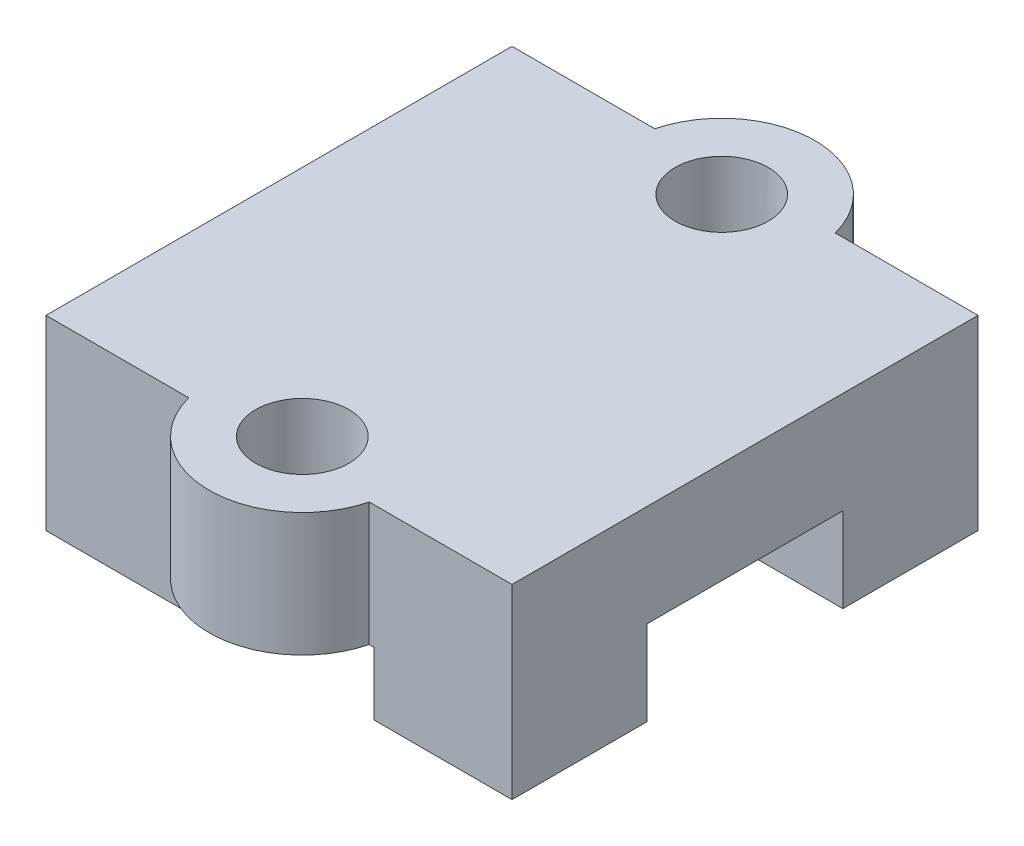
ISO-10303-21;
HEADER;
FILE_DESCRIPTION(('STEP AP214'),'2;1');
FILE_NAME('part.step','',(''),(''),'','','');
FILE_SCHEMA(('AUTOMOTIVE_DESIGN { 1 0 10303 214 1 1 1 1 }'));
ENDSEC;
DATA;
#1=APPLICATION_CONTEXT('core data for automotive mechanical design processes');
#2=APPLICATION_PROTOCOL_DEFINITION('international standard','automotive_design',2000,#1);
#3=PRODUCT_CONTEXT('',#1,'mechanical');
#4=PRODUCT('Part','Part','',(#3));
#5=PRODUCT_RELATED_PRODUCT_CATEGORY('part','',(#4));
#6=PRODUCT_DEFINITION_FORMATION('','',#4);
#7=PRODUCT_DEFINITION_CONTEXT('part definition',#1,'design');
#8=PRODUCT_DEFINITION('design','',#6,#7);
#9=PRODUCT_DEFINITION_SHAPE('','',#8);
#10=(LENGTH_UNIT() NAMED_UNIT(*) SI_UNIT(.MILLI.,.METRE.));
#11=(NAMED_UNIT(*) PLANE_ANGLE_UNIT() SI_UNIT($,.RADIAN.));
#12=(NAMED_UNIT(*) SI_UNIT($,.STERADIAN.) SOLID_ANGLE_UNIT());
#13=UNCERTAINTY_MEASURE_WITH_UNIT(LENGTH_MEASURE(1.E-05),#10,'distance_accuracy_value','');
#14=(GEOMETRIC_REPRESENTATION_CONTEXT(3) GLOBAL_UNCERTAINTY_ASSIGNED_CONTEXT((#13)) GLOBAL_UNIT_ASSIGNED_CONTEXT((#10,
#11,#12)) REPRESENTATION_CONTEXT('',''));
#15=CARTESIAN_POINT('',(0.,0.,0.));
#16=DIRECTION('',(0.,0.,1.));
#17=DIRECTION('',(1.,0.,0.));
#18=AXIS2_PLACEMENT_3D('',#15,#16,#17);
#19=CARTESIAN_POINT('',(-110.,-5.00000000000001,9.));
#20=DIRECTION('',(0.,1.,0.));
#21=DIRECTION('',(0.,0.,1.));
#22=AXIS2_PLACEMENT_3D('',#19,#20,#21);
#23=CYLINDRICAL_SURFACE('',#22,4.00000000000001);
#24=DIRECTION('',(0.,1.,0.));
#25=VECTOR('',#24,1.);
#26=CARTESIAN_POINT('',(-113.872983346207,-5.00000000000001,10.));
#27=LINE('',#26,#25);
#28=CARTESIAN_POINT('',(-113.872983346207,3.00000000000001,10.));
#29=VERTEX_POINT('',#28);
#30=CARTESIAN_POINT('',(-113.872983346207,-2.3,10.));
#31=VERTEX_POINT('',#30);
#32=EDGE_CURVE('E284',#29,#31,#27,.F.);
#33=ORIENTED_EDGE('',*,*,#32,.T.);
#34=CARTESIAN_POINT('',(-110.,-2.3,9.));
#35=DIRECTION('',(0.,-1.,0.));
#36=DIRECTION('',(0.,0.,-1.));
#37=AXIS2_PLACEMENT_3D('',#34,#35,#36);
#38=CIRCLE('',#37,4.00000000000001);
#39=CARTESIAN_POINT('',(-106.127016653793,-2.3,10.));
#40=VERTEX_POINT('',#39);
#41=EDGE_CURVE('E330',#31,#40,#38,.F.);
#42=ORIENTED_EDGE('',*,*,#41,.T.);
#43=DIRECTION('',(0.,1.,0.));
#44=VECTOR('',#43,1.);
#45=CARTESIAN_POINT('',(-106.127016653793,-5.00000000000001,10.));
#46=LINE('',#45,#44);
#47=CARTESIAN_POINT('',(-106.127016653793,3.00000000000001,10.));
#48=VERTEX_POINT('',#47);
#49=EDGE_CURVE('E281',#40,#48,#46,.T.);
#50=ORIENTED_EDGE('',*,*,#49,.T.);
#51=CARTESIAN_POINT('',(-110.,3.00000000000001,9.00000000000001));
#52=DIRECTION('',(0.,1.,0.));
#53=DIRECTION('',(0.,0.,1.));
#54=AXIS2_PLACEMENT_3D('',#51,#52,#53);
#55=CIRCLE('',#54,4.00000000000001);
#56=EDGE_CURVE('E288',#29,#48,#55,.T.);
#57=ORIENTED_EDGE('',*,*,#56,.F.);
#58=EDGE_LOOP('',(#33,#42,#50,#57));
#59=FACE_BOUND('',#58,.T.);
#60=ADVANCED_FACE('F45',(#59),#23,.T.);
#61=CARTESIAN_POINT('',(-110.,-5.,-9.));
#62=DIRECTION('',(0.,1.,0.));
#63=DIRECTION('',(0.,0.,1.));
#64=AXIS2_PLACEMENT_3D('',#61,#62,#63);
#65=CYLINDRICAL_SURFACE('',#64,4.00000000000001);
#66=DIRECTION('',(0.,1.,0.));
#67=VECTOR('',#66,1.);
#68=CARTESIAN_POINT('',(-106.127016653793,-5.,-10.));
#69=LINE('',#68,#67);
#70=CARTESIAN_POINT('',(-106.127016653793,3.00000000000001,-10.));
#71=VERTEX_POINT('',#70);
#72=CARTESIAN_POINT('',(-106.127016653793,-2.3,-10.));
#73=VERTEX_POINT('',#72);
#74=EDGE_CURVE('E295',#71,#73,#69,.F.);
#75=ORIENTED_EDGE('',*,*,#74,.T.);
#76=CARTESIAN_POINT('',(-110.,-2.3,-9.));
#77=DIRECTION('',(0.,-1.,0.));
#78=DIRECTION('',(0.,0.,-1.));
#79=AXIS2_PLACEMENT_3D('',#76,#77,#78);
#80=CIRCLE('',#79,4.00000000000001);
#81=CARTESIAN_POINT('',(-113.872983346207,-2.3,-10.));
#82=VERTEX_POINT('',#81);
#83=EDGE_CURVE('E321',#73,#82,#80,.F.);
#84=ORIENTED_EDGE('',*,*,#83,.T.);
#85=DIRECTION('',(0.,1.,0.));
#86=VECTOR('',#85,1.);
#87=CARTESIAN_POINT('',(-113.872983346207,-5.,-10.));
#88=LINE('',#87,#86);
#89=CARTESIAN_POINT('',(-113.872983346207,3.00000000000001,-10.));
#90=VERTEX_POINT('',#89);
#91=EDGE_CURVE('E292',#82,#90,#88,.T.);
#92=ORIENTED_EDGE('',*,*,#91,.T.);
#93=CARTESIAN_POINT('',(-110.,3.00000000000001,-9.));
#94=DIRECTION('',(0.,1.,0.));
#95=DIRECTION('',(0.,0.,1.));
#96=AXIS2_PLACEMENT_3D('',#93,#94,#95);
#97=CIRCLE('',#96,4.00000000000001);
#98=EDGE_CURVE('E299',#71,#90,#97,.T.);
#99=ORIENTED_EDGE('',*,*,#98,.F.);
#100=EDGE_LOOP('',(#75,#84,#92,#99));
#101=FACE_BOUND('',#100,.T.);
#102=ADVANCED_FACE('F400',(#101),#65,.T.);
#103=CARTESIAN_POINT('',(-110.,-6.99999999999999,-9.));
#104=DIRECTION('',(0.,1.,0.));
#105=DIRECTION('',(0.,0.,1.));
#106=AXIS2_PLACEMENT_3D('',#103,#104,#105);
#107=CYLINDRICAL_SURFACE('',#106,2.);
#108=CARTESIAN_POINT('',(-110.,3.00000000000001,-9.));
#109=DIRECTION('',(0.,1.,0.));
#110=DIRECTION('',(0.,0.,1.));
#111=AXIS2_PLACEMENT_3D('',#108,#109,#110);
#112=CIRCLE('',#111,2.);
#113=CARTESIAN_POINT('',(-110.,3.00000000000001,-7.));
#114=VERTEX_POINT('',#113);
#115=EDGE_CURVE('E179',#114,#114,#112,.T.);
#116=ORIENTED_EDGE('',*,*,#115,.T.);
#117=EDGE_LOOP('',(#116));
#118=FACE_BOUND('',#117,.T.);
#119=CARTESIAN_POINT('',(-110.,-2.3,-9.));
#120=DIRECTION('',(0.,-1.,0.));
#121=DIRECTION('',(0.,0.,-1.));
#122=AXIS2_PLACEMENT_3D('',#119,#120,#121);
#123=CIRCLE('',#122,2.);
#124=CARTESIAN_POINT('',(-110.,-2.3,-11.));
#125=VERTEX_POINT('',#124);
#126=EDGE_CURVE('E333',#125,#125,#123,.T.);
#127=ORIENTED_EDGE('',*,*,#126,.T.);
#128=EDGE_LOOP('',(#127));
#129=FACE_BOUND('',#128,.T.);
#130=ADVANCED_FACE('F415',(#118,#129),#107,.F.);
#131=CARTESIAN_POINT('',(-110.,-6.99999999999999,9.));
#132=DIRECTION('',(0.,1.,0.));
#133=DIRECTION('',(0.,0.,1.));
#134=AXIS2_PLACEMENT_3D('',#131,#132,#133);
#135=CYLINDRICAL_SURFACE('',#134,2.);
#136=CARTESIAN_POINT('',(-110.,3.00000000000001,9.00000000000001));
#137=DIRECTION('',(0.,1.,0.));
#138=DIRECTION('',(0.,0.,1.));
#139=AXIS2_PLACEMENT_3D('',#136,#137,#138);
#140=CIRCLE('',#139,2.);
#141=CARTESIAN_POINT('',(-110.,3.00000000000001,11.));
#142=VERTEX_POINT('',#141);
#143=EDGE_CURVE('E303',#142,#142,#140,.T.);
#144=ORIENTED_EDGE('',*,*,#143,.T.);
#145=EDGE_LOOP('',(#144));
#146=FACE_BOUND('',#145,.T.);
#147=CARTESIAN_POINT('',(-110.,-2.3,9.));
#148=DIRECTION('',(0.,-1.,0.));
#149=DIRECTION('',(0.,0.,-1.));
#150=AXIS2_PLACEMENT_3D('',#147,#148,#149);
#151=CIRCLE('',#150,2.);
#152=CARTESIAN_POINT('',(-110.,-2.3,7.00000000000001));
#153=VERTEX_POINT('',#152);
#154=EDGE_CURVE('E170',#153,#153,#151,.T.);
#155=ORIENTED_EDGE('',*,*,#154,.T.);
#156=EDGE_LOOP('',(#155));
#157=FACE_BOUND('',#156,.T.);
#158=ADVANCED_FACE('F349',(#146,#157),#135,.F.);
#159=CARTESIAN_POINT('',(-120.,-4.99999999999998,-10.));
#160=DIRECTION('',(0.,0.,-1.));
#161=DIRECTION('',(-1.,0.,0.));
#162=AXIS2_PLACEMENT_3D('',#159,#160,#161);
#163=PLANE('',#162);
#164=DIRECTION('',(0.,-1.,0.));
#165=VECTOR('',#164,1.);
#166=CARTESIAN_POINT('',(-114.079215610874,-2.3,-10.));
#167=LINE('',#166,#165);
#168=CARTESIAN_POINT('',(-114.079215610874,-5.,-10.));
#169=VERTEX_POINT('',#168);
#170=CARTESIAN_POINT('',(-114.079215610874,-2.3,-10.));
#171=VERTEX_POINT('',#170);
#172=EDGE_CURVE('E180',#169,#171,#167,.F.);
#173=ORIENTED_EDGE('',*,*,#172,.F.);
#174=DIRECTION('',(1.,0.,0.));
#175=VECTOR('',#174,1.);
#176=CARTESIAN_POINT('',(-120.,-4.99999999999998,-10.));
#177=LINE('',#176,#175);
#178=CARTESIAN_POINT('',(-120.,-4.99999999999998,-10.));
#179=VERTEX_POINT('',#178);
#180=EDGE_CURVE('E202',#179,#169,#177,.T.);
#181=ORIENTED_EDGE('',*,*,#180,.F.);
#182=DIRECTION('',(0.,1.,0.));
#183=VECTOR('',#182,1.);
#184=CARTESIAN_POINT('',(-120.,-4.99999999999998,-10.));
#185=LINE('',#184,#183);
#186=CARTESIAN_POINT('',(-120.,3.00000000000001,-10.));
#187=VERTEX_POINT('',#186);
#188=EDGE_CURVE('E226',#179,#187,#185,.T.);
#189=ORIENTED_EDGE('',*,*,#188,.T.);
#190=DIRECTION('',(1.,0.,0.));
#191=VECTOR('',#190,1.);
#192=CARTESIAN_POINT('',(-120.,3.00000000000001,-10.));
#193=LINE('',#192,#191);
#194=EDGE_CURVE('E197',#187,#90,#193,.T.);
#195=ORIENTED_EDGE('',*,*,#194,.T.);
#196=ORIENTED_EDGE('',*,*,#91,.F.);
#197=DIRECTION('',(-1.,0.,0.));
#198=VECTOR('',#197,1.);
#199=CARTESIAN_POINT('',(-120.,-2.3,-10.));
#200=LINE('',#199,#198);
#201=EDGE_CURVE('E69',#82,#171,#200,.T.);
#202=ORIENTED_EDGE('',*,*,#201,.T.);
#203=EDGE_LOOP('',(#173,#181,#189,#195,#196,#202));
#204=FACE_BOUND('',#203,.T.);
#205=ADVANCED_FACE('F394',(#204),#163,.T.);
#206=CARTESIAN_POINT('',(-120.,3.00000000000001,10.));
#207=DIRECTION('',(0.,0.,1.));
#208=DIRECTION('',(1.,0.,0.));
#209=AXIS2_PLACEMENT_3D('',#206,#207,#208);
#210=PLANE('',#209);
#211=DIRECTION('',(0.,-1.,0.));
#212=VECTOR('',#211,1.);
#213=CARTESIAN_POINT('',(-105.920784389126,-2.3,10.));
#214=LINE('',#213,#212);
#215=CARTESIAN_POINT('',(-105.920784389126,-5.,10.));
#216=VERTEX_POINT('',#215);
#217=CARTESIAN_POINT('',(-105.920784389126,-2.3,10.));
#218=VERTEX_POINT('',#217);
#219=EDGE_CURVE('E163',#216,#218,#214,.F.);
#220=ORIENTED_EDGE('',*,*,#219,.F.);
#221=DIRECTION('',(1.,0.,0.));
#222=VECTOR('',#221,1.);
#223=CARTESIAN_POINT('',(-120.,-5.,10.));
#224=LINE('',#223,#222);
#225=CARTESIAN_POINT('',(-100.,-5.,10.));
#226=VERTEX_POINT('',#225);
#227=EDGE_CURVE('E175',#216,#226,#224,.T.);
#228=ORIENTED_EDGE('',*,*,#227,.T.);
#229=DIRECTION('',(0.,-1.,0.));
#230=VECTOR('',#229,1.);
#231=CARTESIAN_POINT('',(-100.,3.00000000000001,10.));
#232=LINE('',#231,#230);
#233=CARTESIAN_POINT('',(-100.,3.00000000000001,10.));
#234=VERTEX_POINT('',#233);
#235=EDGE_CURVE('E252',#234,#226,#232,.T.);
#236=ORIENTED_EDGE('',*,*,#235,.F.);
#237=DIRECTION('',(1.,0.,0.));
#238=VECTOR('',#237,1.);
#239=CARTESIAN_POINT('',(-120.,3.00000000000001,10.));
#240=LINE('',#239,#238);
#241=EDGE_CURVE('E191',#48,#234,#240,.T.);
#242=ORIENTED_EDGE('',*,*,#241,.F.);
#243=ORIENTED_EDGE('',*,*,#49,.F.);
#244=DIRECTION('',(1.,0.,0.));
#245=VECTOR('',#244,1.);
#246=CARTESIAN_POINT('',(-120.,-2.3,10.));
#247=LINE('',#246,#245);
#248=EDGE_CURVE('E61',#40,#218,#247,.T.);
#249=ORIENTED_EDGE('',*,*,#248,.T.);
#250=EDGE_LOOP('',(#220,#228,#236,#242,#243,#249));
#251=FACE_BOUND('',#250,.T.);
#252=ADVANCED_FACE('F173',(#251),#210,.T.);
#253=CARTESIAN_POINT('',(-120.,-5.,10.));
#254=DIRECTION('',(0.,-1.,0.));
#255=DIRECTION('',(0.,0.,-1.));
#256=AXIS2_PLACEMENT_3D('',#253,#254,#255);
#257=PLANE('',#256);
#258=CARTESIAN_POINT('',(-110.,-5.,9.));
#259=DIRECTION('',(0.,-1.,0.));
#260=DIRECTION('',(0.,0.,-1.));
#261=AXIS2_PLACEMENT_3D('',#258,#259,#260);
#262=CIRCLE('',#261,4.19999999999999);
#263=CARTESIAN_POINT('',(-114.079215610874,-5.,10.));
#264=VERTEX_POINT('',#263);
#265=EDGE_CURVE('E159',#264,#216,#262,.T.);
#266=ORIENTED_EDGE('',*,*,#265,.F.);
#267=CARTESIAN_POINT('',(-120.,-5.,10.));
#268=VERTEX_POINT('',#267);
#269=EDGE_CURVE('E54',#268,#264,#224,.T.);
#270=ORIENTED_EDGE('',*,*,#269,.F.);
#271=DIRECTION('',(0.,0.,-1.));
#272=VECTOR('',#271,1.);
#273=CARTESIAN_POINT('',(-120.,-5.,10.));
#274=LINE('',#273,#272);
#275=CARTESIAN_POINT('',(-120.,-5.,4.2));
#276=VERTEX_POINT('',#275);
#277=EDGE_CURVE('E249',#268,#276,#274,.T.);
#278=ORIENTED_EDGE('',*,*,#277,.T.);
#279=DIRECTION('',(1.,0.,0.));
#280=VECTOR('',#279,1.);
#281=CARTESIAN_POINT('',(-120.,-5.,4.2));
#282=LINE('',#281,#280);
#283=CARTESIAN_POINT('',(-100.,-5.,4.2));
#284=VERTEX_POINT('',#283);
#285=EDGE_CURVE('E215',#276,#284,#282,.T.);
#286=ORIENTED_EDGE('',*,*,#285,.T.);
#287=DIRECTION('',(0.,0.,-1.));
#288=VECTOR('',#287,1.);
#289=CARTESIAN_POINT('',(-100.,-5.,10.));
#290=LINE('',#289,#288);
#291=EDGE_CURVE('E184',#226,#284,#290,.T.);
#292=ORIENTED_EDGE('',*,*,#291,.F.);
#293=ORIENTED_EDGE('',*,*,#227,.F.);
#294=EDGE_LOOP('',(#266,#270,#278,#286,#292,#293));
#295=FACE_BOUND('',#294,.T.);
#296=ADVANCED_FACE('F47',(#295),#257,.T.);
#297=DIRECTION('',(0.,-1.,0.));
#298=VECTOR('',#297,1.);
#299=CARTESIAN_POINT('',(-114.079215610874,-2.3,10.));
#300=LINE('',#299,#298);
#301=CARTESIAN_POINT('',(-114.079215610874,-2.3,10.));
#302=VERTEX_POINT('',#301);
#303=EDGE_CURVE('E11',#302,#264,#300,.T.);
#304=ORIENTED_EDGE('',*,*,#303,.F.);
#305=DIRECTION('',(1.,0.,0.));
#306=VECTOR('',#305,1.);
#307=CARTESIAN_POINT('',(-120.,-2.3,10.));
#308=LINE('',#307,#306);
#309=EDGE_CURVE('E326',#302,#31,#308,.T.);
#310=ORIENTED_EDGE('',*,*,#309,.T.);
#311=ORIENTED_EDGE('',*,*,#32,.F.);
#312=CARTESIAN_POINT('',(-120.,3.00000000000001,10.));
#313=VERTEX_POINT('',#312);
#314=EDGE_CURVE('E186',#313,#29,#240,.T.);
#315=ORIENTED_EDGE('',*,*,#314,.F.);
#316=DIRECTION('',(0.,-1.,0.));
#317=VECTOR('',#316,1.);
#318=CARTESIAN_POINT('',(-120.,3.00000000000001,10.));
#319=LINE('',#318,#317);
#320=EDGE_CURVE('E194',#313,#268,#319,.T.);
#321=ORIENTED_EDGE('',*,*,#320,.T.);
#322=ORIENTED_EDGE('',*,*,#269,.T.);
#323=EDGE_LOOP('',(#304,#310,#311,#315,#321,#322));
#324=FACE_BOUND('',#323,.T.);
#325=ADVANCED_FACE('F357',(#324),#210,.T.);
#326=CARTESIAN_POINT('',(-120.,3.00000000000001,-10.));
#327=DIRECTION('',(0.,1.,0.));
#328=DIRECTION('',(0.,0.,1.));
#329=AXIS2_PLACEMENT_3D('',#326,#327,#328);
#330=PLANE('',#329);
#331=ORIENTED_EDGE('',*,*,#143,.F.);
#332=EDGE_LOOP('',(#331));
#333=FACE_BOUND('',#332,.T.);
#334=ORIENTED_EDGE('',*,*,#115,.F.);
#335=EDGE_LOOP('',(#334));
#336=FACE_BOUND('',#335,.T.);
#337=CARTESIAN_POINT('',(-100.,3.00000000000001,-10.));
#338=VERTEX_POINT('',#337);
#339=EDGE_CURVE('E201',#71,#338,#193,.T.);
#340=ORIENTED_EDGE('',*,*,#339,.F.);
#341=ORIENTED_EDGE('',*,*,#98,.T.);
#342=ORIENTED_EDGE('',*,*,#194,.F.);
#343=DIRECTION('',(0.,0.,1.));
#344=VECTOR('',#343,1.);
#345=CARTESIAN_POINT('',(-120.,3.00000000000001,-10.));
#346=LINE('',#345,#344);
#347=EDGE_CURVE('E221',#187,#313,#346,.T.);
#348=ORIENTED_EDGE('',*,*,#347,.T.);
#349=ORIENTED_EDGE('',*,*,#314,.T.);
#350=ORIENTED_EDGE('',*,*,#56,.T.);
#351=ORIENTED_EDGE('',*,*,#241,.T.);
#352=DIRECTION('',(0.,0.,1.));
#353=VECTOR('',#352,1.);
#354=CARTESIAN_POINT('',(-100.,3.00000000000001,-10.));
#355=LINE('',#354,#353);
#356=EDGE_CURVE('E255',#338,#234,#355,.T.);
#357=ORIENTED_EDGE('',*,*,#356,.F.);
#358=EDGE_LOOP('',(#340,#341,#342,#348,#349,#350,#351,#357));
#359=FACE_BOUND('',#358,.T.);
#360=ADVANCED_FACE('F359',(#333,#336,#359),#330,.T.);
#361=DIRECTION('',(0.,-1.,0.));
#362=VECTOR('',#361,1.);
#363=CARTESIAN_POINT('',(-105.920784389126,-2.3,-10.));
#364=LINE('',#363,#362);
#365=CARTESIAN_POINT('',(-105.920784389126,-2.3,-10.));
#366=VERTEX_POINT('',#365);
#367=CARTESIAN_POINT('',(-105.920784389126,-5.,-10.));
#368=VERTEX_POINT('',#367);
#369=EDGE_CURVE('E312',#366,#368,#364,.T.);
#370=ORIENTED_EDGE('',*,*,#369,.F.);
#371=DIRECTION('',(-1.,0.,0.));
#372=VECTOR('',#371,1.);
#373=CARTESIAN_POINT('',(-120.,-2.3,-10.));
#374=LINE('',#373,#372);
#375=EDGE_CURVE('E317',#366,#73,#374,.T.);
#376=ORIENTED_EDGE('',*,*,#375,.T.);
#377=ORIENTED_EDGE('',*,*,#74,.F.);
#378=ORIENTED_EDGE('',*,*,#339,.T.);
#379=DIRECTION('',(0.,1.,0.));
#380=VECTOR('',#379,1.);
#381=CARTESIAN_POINT('',(-100.,-4.99999999999998,-10.));
#382=LINE('',#381,#380);
#383=CARTESIAN_POINT('',(-100.,-4.99999999999998,-10.));
#384=VERTEX_POINT('',#383);
#385=EDGE_CURVE('E259',#384,#338,#382,.T.);
#386=ORIENTED_EDGE('',*,*,#385,.F.);
#387=EDGE_CURVE('E206',#368,#384,#177,.T.);
#388=ORIENTED_EDGE('',*,*,#387,.F.);
#389=EDGE_LOOP('',(#370,#376,#377,#378,#386,#388));
#390=FACE_BOUND('',#389,.T.);
#391=ADVANCED_FACE('F375',(#390),#163,.T.);
#392=CARTESIAN_POINT('',(-120.,-4.99999999999999,-4.2));
#393=DIRECTION('',(0.,-1.,0.));
#394=DIRECTION('',(0.,0.,-1.));
#395=AXIS2_PLACEMENT_3D('',#392,#393,#394);
#396=PLANE('',#395);
#397=CARTESIAN_POINT('',(-110.,-5.,-9.));
#398=DIRECTION('',(0.,-1.,0.));
#399=DIRECTION('',(0.,0.,-1.));
#400=AXIS2_PLACEMENT_3D('',#397,#398,#399);
#401=CIRCLE('',#400,4.19999999999999);
#402=EDGE_CURVE('E337',#368,#169,#401,.T.);
#403=ORIENTED_EDGE('',*,*,#402,.F.);
#404=ORIENTED_EDGE('',*,*,#387,.T.);
#405=DIRECTION('',(0.,0.,-1.));
#406=VECTOR('',#405,1.);
#407=CARTESIAN_POINT('',(-100.,-4.99999999999999,-4.2));
#408=LINE('',#407,#406);
#409=CARTESIAN_POINT('',(-100.,-4.99999999999999,-4.2));
#410=VERTEX_POINT('',#409);
#411=EDGE_CURVE('E263',#410,#384,#408,.T.);
#412=ORIENTED_EDGE('',*,*,#411,.F.);
#413=DIRECTION('',(1.,0.,0.));
#414=VECTOR('',#413,1.);
#415=CARTESIAN_POINT('',(-120.,-4.99999999999999,-4.2));
#416=LINE('',#415,#414);
#417=CARTESIAN_POINT('',(-120.,-4.99999999999999,-4.2));
#418=VERTEX_POINT('',#417);
#419=EDGE_CURVE('E207',#418,#410,#416,.T.);
#420=ORIENTED_EDGE('',*,*,#419,.F.);
#421=DIRECTION('',(0.,0.,-1.));
#422=VECTOR('',#421,1.);
#423=CARTESIAN_POINT('',(-120.,-4.99999999999999,-4.2));
#424=LINE('',#423,#422);
#425=EDGE_CURVE('E231',#418,#179,#424,.T.);
#426=ORIENTED_EDGE('',*,*,#425,.T.);
#427=ORIENTED_EDGE('',*,*,#180,.T.);
#428=EDGE_LOOP('',(#403,#404,#412,#420,#426,#427));
#429=FACE_BOUND('',#428,.T.);
#430=ADVANCED_FACE('F368',(#429),#396,.T.);
#431=CARTESIAN_POINT('',(-120.,-1.3625,-4.2));
#432=DIRECTION('',(0.,0.,1.));
#433=DIRECTION('',(0.,-1.,0.));
#434=AXIS2_PLACEMENT_3D('',#431,#432,#433);
#435=PLANE('',#434);
#436=ORIENTED_EDGE('',*,*,#419,.T.);
#437=DIRECTION('',(0.,-1.,0.));
#438=VECTOR('',#437,1.);
#439=CARTESIAN_POINT('',(-100.,-1.3625,-4.2));
#440=LINE('',#439,#438);
#441=CARTESIAN_POINT('',(-100.,-1.3625,-4.2));
#442=VERTEX_POINT('',#441);
#443=EDGE_CURVE('E267',#442,#410,#440,.T.);
#444=ORIENTED_EDGE('',*,*,#443,.F.);
#445=DIRECTION('',(1.,0.,0.));
#446=VECTOR('',#445,1.);
#447=CARTESIAN_POINT('',(-120.,-1.3625,-4.2));
#448=LINE('',#447,#446);
#449=CARTESIAN_POINT('',(-120.,-1.3625,-4.2));
#450=VERTEX_POINT('',#449);
#451=EDGE_CURVE('E210',#450,#442,#448,.T.);
#452=ORIENTED_EDGE('',*,*,#451,.F.);
#453=DIRECTION('',(0.,-1.,0.));
#454=VECTOR('',#453,1.);
#455=CARTESIAN_POINT('',(-120.,-1.3625,-4.2));
#456=LINE('',#455,#454);
#457=EDGE_CURVE('E237',#450,#418,#456,.T.);
#458=ORIENTED_EDGE('',*,*,#457,.T.);
#459=EDGE_LOOP('',(#436,#444,#452,#458));
#460=FACE_BOUND('',#459,.T.);
#461=ADVANCED_FACE('F385',(#460),#435,.T.);
#462=CARTESIAN_POINT('',(-120.,-1.3625,4.2));
#463=DIRECTION('',(0.,-1.,0.));
#464=DIRECTION('',(0.,0.,-1.));
#465=AXIS2_PLACEMENT_3D('',#462,#463,#464);
#466=PLANE('',#465);
#467=ORIENTED_EDGE('',*,*,#451,.T.);
#468=DIRECTION('',(0.,0.,-1.));
#469=VECTOR('',#468,1.);
#470=CARTESIAN_POINT('',(-100.,-1.3625,4.2));
#471=LINE('',#470,#469);
#472=CARTESIAN_POINT('',(-100.,-1.3625,4.2));
#473=VERTEX_POINT('',#472);
#474=EDGE_CURVE('E271',#473,#442,#471,.T.);
#475=ORIENTED_EDGE('',*,*,#474,.F.);
#476=DIRECTION('',(1.,0.,0.));
#477=VECTOR('',#476,1.);
#478=CARTESIAN_POINT('',(-120.,-1.3625,4.2));
#479=LINE('',#478,#477);
#480=CARTESIAN_POINT('',(-120.,-1.3625,4.2));
#481=VERTEX_POINT('',#480);
#482=EDGE_CURVE('E213',#481,#473,#479,.T.);
#483=ORIENTED_EDGE('',*,*,#482,.F.);
#484=DIRECTION('',(0.,0.,-1.));
#485=VECTOR('',#484,1.);
#486=CARTESIAN_POINT('',(-120.,-1.3625,4.2));
#487=LINE('',#486,#485);
#488=EDGE_CURVE('E241',#481,#450,#487,.T.);
#489=ORIENTED_EDGE('',*,*,#488,.T.);
#490=EDGE_LOOP('',(#467,#475,#483,#489));
#491=FACE_BOUND('',#490,.T.);
#492=ADVANCED_FACE('F381',(#491),#466,.T.);
#493=CARTESIAN_POINT('',(-120.,-5.,4.2));
#494=DIRECTION('',(0.,0.,-1.));
#495=DIRECTION('',(-1.,0.,0.));
#496=AXIS2_PLACEMENT_3D('',#493,#494,#495);
#497=PLANE('',#496);
#498=ORIENTED_EDGE('',*,*,#482,.T.);
#499=DIRECTION('',(0.,1.,0.));
#500=VECTOR('',#499,1.);
#501=CARTESIAN_POINT('',(-100.,-5.,4.2));
#502=LINE('',#501,#500);
#503=EDGE_CURVE('E275',#284,#473,#502,.T.);
#504=ORIENTED_EDGE('',*,*,#503,.F.);
#505=ORIENTED_EDGE('',*,*,#285,.F.);
#506=DIRECTION('',(0.,1.,0.));
#507=VECTOR('',#506,1.);
#508=CARTESIAN_POINT('',(-120.,-5.,4.2));
#509=LINE('',#508,#507);
#510=EDGE_CURVE('E245',#276,#481,#509,.T.);
#511=ORIENTED_EDGE('',*,*,#510,.T.);
#512=EDGE_LOOP('',(#498,#504,#505,#511));
#513=FACE_BOUND('',#512,.T.);
#514=ADVANCED_FACE('F401',(#513),#497,.T.);
#515=CARTESIAN_POINT('',(-120.,0.,0.));
#516=DIRECTION('',(1.,0.,0.));
#517=DIRECTION('',(0.,0.,-1.));
#518=AXIS2_PLACEMENT_3D('',#515,#516,#517);
#519=PLANE('',#518);
#520=ORIENTED_EDGE('',*,*,#277,.F.);
#521=ORIENTED_EDGE('',*,*,#320,.F.);
#522=ORIENTED_EDGE('',*,*,#347,.F.);
#523=ORIENTED_EDGE('',*,*,#188,.F.);
#524=ORIENTED_EDGE('',*,*,#425,.F.);
#525=ORIENTED_EDGE('',*,*,#457,.F.);
#526=ORIENTED_EDGE('',*,*,#488,.F.);
#527=ORIENTED_EDGE('',*,*,#510,.F.);
#528=EDGE_LOOP('',(#520,#521,#522,#523,#524,#525,#526,#527));
#529=FACE_BOUND('',#528,.T.);
#530=ADVANCED_FACE('F389',(#529),#519,.F.);
#531=CARTESIAN_POINT('',(-100.,0.,0.));
#532=DIRECTION('',(1.,0.,0.));
#533=DIRECTION('',(0.,0.,-1.));
#534=AXIS2_PLACEMENT_3D('',#531,#532,#533);
#535=PLANE('',#534);
#536=ORIENTED_EDGE('',*,*,#291,.T.);
#537=ORIENTED_EDGE('',*,*,#503,.T.);
#538=ORIENTED_EDGE('',*,*,#474,.T.);
#539=ORIENTED_EDGE('',*,*,#443,.T.);
#540=ORIENTED_EDGE('',*,*,#411,.T.);
#541=ORIENTED_EDGE('',*,*,#385,.T.);
#542=ORIENTED_EDGE('',*,*,#356,.T.);
#543=ORIENTED_EDGE('',*,*,#235,.T.);
#544=EDGE_LOOP('',(#536,#537,#538,#539,#540,#541,#542,#543));
#545=FACE_BOUND('',#544,.T.);
#546=ADVANCED_FACE('F373',(#545),#535,.T.);
#547=CARTESIAN_POINT('',(-110.,-2.3,9.));
#548=DIRECTION('',(0.,-1.,0.));
#549=DIRECTION('',(0.,0.,-1.));
#550=AXIS2_PLACEMENT_3D('',#547,#548,#549);
#551=CYLINDRICAL_SURFACE('',#550,4.19999999999999);
#552=ORIENTED_EDGE('',*,*,#219,.T.);
#553=CARTESIAN_POINT('',(-110.,-2.3,9.));
#554=DIRECTION('',(0.,-1.,0.));
#555=DIRECTION('',(0.,0.,-1.));
#556=AXIS2_PLACEMENT_3D('',#553,#554,#555);
#557=CIRCLE('',#556,4.19999999999999);
#558=EDGE_CURVE('E169',#302,#218,#557,.T.);
#559=ORIENTED_EDGE('',*,*,#558,.F.);
#560=ORIENTED_EDGE('',*,*,#303,.T.);
#561=ORIENTED_EDGE('',*,*,#265,.T.);
#562=EDGE_LOOP('',(#552,#559,#560,#561));
#563=FACE_BOUND('',#562,.T.);
#564=ADVANCED_FACE('F161',(#563),#551,.F.);
#565=CARTESIAN_POINT('',(-110.,-2.3,9.));
#566=DIRECTION('',(0.,-1.,0.));
#567=DIRECTION('',(0.,0.,-1.));
#568=AXIS2_PLACEMENT_3D('',#565,#566,#567);
#569=PLANE('',#568);
#570=ORIENTED_EDGE('',*,*,#154,.F.);
#571=EDGE_LOOP('',(#570));
#572=FACE_BOUND('',#571,.T.);
#573=ORIENTED_EDGE('',*,*,#41,.F.);
#574=ORIENTED_EDGE('',*,*,#309,.F.);
#575=ORIENTED_EDGE('',*,*,#558,.T.);
#576=ORIENTED_EDGE('',*,*,#248,.F.);
#577=EDGE_LOOP('',(#573,#574,#575,#576));
#578=FACE_BOUND('',#577,.T.);
#579=ADVANCED_FACE('F351',(#572,#578),#569,.T.);
#580=CARTESIAN_POINT('',(-110.,-2.3,-9.));
#581=DIRECTION('',(0.,-1.,0.));
#582=DIRECTION('',(0.,0.,-1.));
#583=AXIS2_PLACEMENT_3D('',#580,#581,#582);
#584=CYLINDRICAL_SURFACE('',#583,4.19999999999999);
#585=ORIENTED_EDGE('',*,*,#172,.T.);
#586=CARTESIAN_POINT('',(-110.,-2.3,-9.));
#587=DIRECTION('',(0.,-1.,0.));
#588=DIRECTION('',(0.,0.,-1.));
#589=AXIS2_PLACEMENT_3D('',#586,#587,#588);
#590=CIRCLE('',#589,4.19999999999999);
#591=EDGE_CURVE('E338',#366,#171,#590,.T.);
#592=ORIENTED_EDGE('',*,*,#591,.F.);
#593=ORIENTED_EDGE('',*,*,#369,.T.);
#594=ORIENTED_EDGE('',*,*,#402,.T.);
#595=EDGE_LOOP('',(#585,#592,#593,#594));
#596=FACE_BOUND('',#595,.T.);
#597=ADVANCED_FACE('F353',(#596),#584,.F.);
#598=CARTESIAN_POINT('',(-110.,-2.3,-9.));
#599=DIRECTION('',(0.,-1.,0.));
#600=DIRECTION('',(0.,0.,-1.));
#601=AXIS2_PLACEMENT_3D('',#598,#599,#600);
#602=PLANE('',#601);
#603=ORIENTED_EDGE('',*,*,#126,.F.);
#604=EDGE_LOOP('',(#603));
#605=FACE_BOUND('',#604,.T.);
#606=ORIENTED_EDGE('',*,*,#83,.F.);
#607=ORIENTED_EDGE('',*,*,#375,.F.);
#608=ORIENTED_EDGE('',*,*,#591,.T.);
#609=ORIENTED_EDGE('',*,*,#201,.F.);
#610=EDGE_LOOP('',(#606,#607,#608,#609));
#611=FACE_BOUND('',#610,.T.);
#612=ADVANCED_FACE('F398',(#605,#611),#602,.T.);
#613=CLOSED_SHELL('',(#60,#102,#130,#158,#205,#252,#296,#325,#360,#391,#430,#461,#492,#514,#530,
#546,#564,#579,#597,#612));
#614=MANIFOLD_SOLID_BREP('B2',#613);
#615=ADVANCED_BREP_SHAPE_REPRESENTATION('',(#18,#614),#14);
#616=SHAPE_DEFINITION_REPRESENTATION(#9,#615);
ENDSEC;
END-ISO-10303-21;
